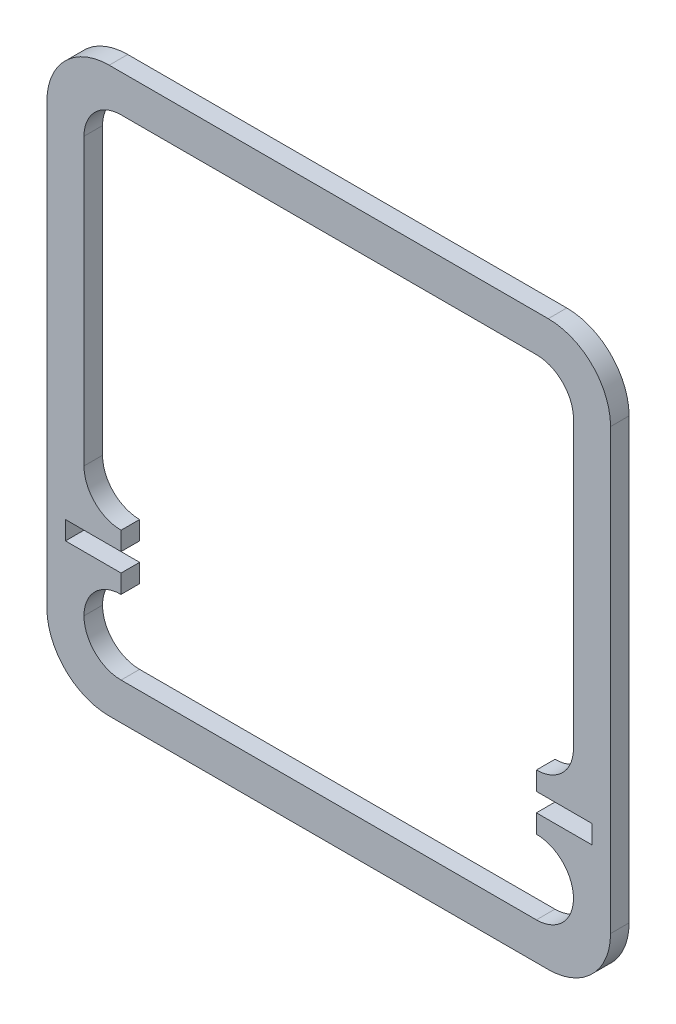
ISO-10303-21;
HEADER;
FILE_DESCRIPTION(('STEP AP214'),'2;1');
FILE_NAME('part.step','',(''),(''),'','','');
FILE_SCHEMA(('AUTOMOTIVE_DESIGN { 1 0 10303 214 1 1 1 1 }'));
ENDSEC;
DATA;
#1=APPLICATION_CONTEXT('core data for automotive mechanical design processes');
#2=APPLICATION_PROTOCOL_DEFINITION('international standard','automotive_design',2000,#1);
#3=PRODUCT_CONTEXT('',#1,'mechanical');
#4=PRODUCT('Part','Part','',(#3));
#5=PRODUCT_RELATED_PRODUCT_CATEGORY('part','',(#4));
#6=PRODUCT_DEFINITION_FORMATION('','',#4);
#7=PRODUCT_DEFINITION_CONTEXT('part definition',#1,'design');
#8=PRODUCT_DEFINITION('design','',#6,#7);
#9=PRODUCT_DEFINITION_SHAPE('','',#8);
#10=(LENGTH_UNIT() NAMED_UNIT(*) SI_UNIT(.MILLI.,.METRE.));
#11=(NAMED_UNIT(*) PLANE_ANGLE_UNIT() SI_UNIT($,.RADIAN.));
#12=(NAMED_UNIT(*) SI_UNIT($,.STERADIAN.) SOLID_ANGLE_UNIT());
#13=UNCERTAINTY_MEASURE_WITH_UNIT(LENGTH_MEASURE(1.E-05),#10,'distance_accuracy_value','');
#14=(GEOMETRIC_REPRESENTATION_CONTEXT(3) GLOBAL_UNCERTAINTY_ASSIGNED_CONTEXT((#13)) GLOBAL_UNIT_ASSIGNED_CONTEXT((#10,
#11,#12)) REPRESENTATION_CONTEXT('',''));
#15=CARTESIAN_POINT('',(0.,0.,0.));
#16=DIRECTION('',(0.,0.,1.));
#17=DIRECTION('',(1.,0.,0.));
#18=AXIS2_PLACEMENT_3D('',#15,#16,#17);
#19=CARTESIAN_POINT('',(0.,0.,3.175));
#20=DIRECTION('',(0.,0.,-1.));
#21=DIRECTION('',(-1.,0.,0.));
#22=AXIS2_PLACEMENT_3D('',#19,#20,#21);
#23=PLANE('',#22);
#24=DIRECTION('',(1.,0.,0.));
#25=VECTOR('',#24,1.);
#26=CARTESIAN_POINT('',(-48.26,-48.26,3.175));
#27=LINE('',#26,#25);
#28=CARTESIAN_POINT('',(-37.592,-48.26,3.175));
#29=VERTEX_POINT('',#28);
#30=CARTESIAN_POINT('',(37.592,-48.26,3.175));
#31=VERTEX_POINT('',#30);
#32=EDGE_CURVE('E383',#29,#31,#27,.T.);
#33=ORIENTED_EDGE('',*,*,#32,.T.);
#34=CARTESIAN_POINT('',(37.592,-37.592,3.175));
#35=DIRECTION('',(0.,0.,-1.));
#36=DIRECTION('',(-1.,0.,0.));
#37=AXIS2_PLACEMENT_3D('',#34,#35,#36);
#38=CIRCLE('',#37,10.668);
#39=CARTESIAN_POINT('',(48.26,-37.592,3.175));
#40=VERTEX_POINT('',#39);
#41=EDGE_CURVE('E420',#31,#40,#38,.F.);
#42=ORIENTED_EDGE('',*,*,#41,.T.);
#43=DIRECTION('',(0.,1.,0.));
#44=VECTOR('',#43,1.);
#45=CARTESIAN_POINT('',(48.26,-48.26,3.175));
#46=LINE('',#45,#44);
#47=CARTESIAN_POINT('',(48.26,37.592,3.175));
#48=VERTEX_POINT('',#47);
#49=EDGE_CURVE('E373',#40,#48,#46,.T.);
#50=ORIENTED_EDGE('',*,*,#49,.T.);
#51=CARTESIAN_POINT('',(37.592,37.592,3.175));
#52=DIRECTION('',(0.,0.,-1.));
#53=DIRECTION('',(-1.,0.,0.));
#54=AXIS2_PLACEMENT_3D('',#51,#52,#53);
#55=CIRCLE('',#54,10.668);
#56=CARTESIAN_POINT('',(37.592,48.26,3.175));
#57=VERTEX_POINT('',#56);
#58=EDGE_CURVE('E418',#48,#57,#55,.F.);
#59=ORIENTED_EDGE('',*,*,#58,.T.);
#60=DIRECTION('',(-1.,0.,0.));
#61=VECTOR('',#60,1.);
#62=CARTESIAN_POINT('',(-48.26,48.26,3.175));
#63=LINE('',#62,#61);
#64=CARTESIAN_POINT('',(-37.592,48.26,3.175));
#65=VERTEX_POINT('',#64);
#66=EDGE_CURVE('E376',#57,#65,#63,.T.);
#67=ORIENTED_EDGE('',*,*,#66,.T.);
#68=CARTESIAN_POINT('',(-37.592,37.592,3.175));
#69=DIRECTION('',(0.,0.,-1.));
#70=DIRECTION('',(-1.,0.,0.));
#71=AXIS2_PLACEMENT_3D('',#68,#69,#70);
#72=CIRCLE('',#71,10.668);
#73=CARTESIAN_POINT('',(-48.26,37.592,3.175));
#74=VERTEX_POINT('',#73);
#75=EDGE_CURVE('E416',#65,#74,#72,.F.);
#76=ORIENTED_EDGE('',*,*,#75,.T.);
#77=DIRECTION('',(0.,-1.,0.));
#78=VECTOR('',#77,1.);
#79=CARTESIAN_POINT('',(-48.26,-48.26,3.175));
#80=LINE('',#79,#78);
#81=CARTESIAN_POINT('',(-48.26,-37.592,3.175));
#82=VERTEX_POINT('',#81);
#83=EDGE_CURVE('E380',#74,#82,#80,.T.);
#84=ORIENTED_EDGE('',*,*,#83,.T.);
#85=CARTESIAN_POINT('',(-37.592,-37.592,3.175));
#86=DIRECTION('',(0.,0.,-1.));
#87=DIRECTION('',(-1.,0.,0.));
#88=AXIS2_PLACEMENT_3D('',#85,#86,#87);
#89=CIRCLE('',#88,10.668);
#90=EDGE_CURVE('E414',#82,#29,#89,.F.);
#91=ORIENTED_EDGE('',*,*,#90,.T.);
#92=EDGE_LOOP('',(#33,#42,#50,#59,#67,#76,#84,#91));
#93=FACE_BOUND('',#92,.T.);
#94=DIRECTION('',(1.,0.,0.));
#95=VECTOR('',#94,1.);
#96=CARTESIAN_POINT('',(-41.91,-41.91,3.175));
#97=LINE('',#96,#95);
#98=CARTESIAN_POINT('',(-35.56,-41.91,3.175));
#99=VERTEX_POINT('',#98);
#100=CARTESIAN_POINT('',(35.56,-41.91,3.175));
#101=VERTEX_POINT('',#100);
#102=EDGE_CURVE('E260',#99,#101,#97,.T.);
#103=ORIENTED_EDGE('',*,*,#102,.F.);
#104=CARTESIAN_POINT('',(-35.56,-35.56,3.175));
#105=DIRECTION('',(0.,0.,-1.));
#106=DIRECTION('',(-1.,0.,0.));
#107=AXIS2_PLACEMENT_3D('',#104,#105,#106);
#108=CIRCLE('',#107,6.35);
#109=CARTESIAN_POINT('',(-41.91,-35.56,3.175));
#110=VERTEX_POINT('',#109);
#111=EDGE_CURVE('E299',#99,#110,#108,.T.);
#112=ORIENTED_EDGE('',*,*,#111,.T.);
#113=CARTESIAN_POINT('',(-35.56,-35.56,3.175));
#114=DIRECTION('',(0.,0.,-1.));
#115=DIRECTION('',(-1.,0.,0.));
#116=AXIS2_PLACEMENT_3D('',#113,#114,#115);
#117=CIRCLE('',#116,6.35);
#118=CARTESIAN_POINT('',(-35.56,-29.21,3.175));
#119=VERTEX_POINT('',#118);
#120=EDGE_CURVE('E11',#110,#119,#117,.T.);
#121=ORIENTED_EDGE('',*,*,#120,.T.);
#122=DIRECTION('',(0.,-1.,0.));
#123=VECTOR('',#122,1.);
#124=CARTESIAN_POINT('',(-35.56,-26.035,3.175));
#125=LINE('',#124,#123);
#126=CARTESIAN_POINT('',(-35.56,-26.035,3.175));
#127=VERTEX_POINT('',#126);
#128=EDGE_CURVE('E353',#127,#119,#125,.T.);
#129=ORIENTED_EDGE('',*,*,#128,.F.);
#130=DIRECTION('',(1.,0.,0.));
#131=VECTOR('',#130,1.);
#132=CARTESIAN_POINT('',(-45.085,-26.035,3.175));
#133=LINE('',#132,#131);
#134=CARTESIAN_POINT('',(-45.085,-26.035,3.175));
#135=VERTEX_POINT('',#134);
#136=EDGE_CURVE('E478',#135,#127,#133,.T.);
#137=ORIENTED_EDGE('',*,*,#136,.F.);
#138=DIRECTION('',(0.,-1.,0.));
#139=VECTOR('',#138,1.);
#140=CARTESIAN_POINT('',(-45.085,-26.035,3.175));
#141=LINE('',#140,#139);
#142=CARTESIAN_POINT('',(-45.085,-22.86,3.175));
#143=VERTEX_POINT('',#142);
#144=EDGE_CURVE('E476',#143,#135,#141,.T.);
#145=ORIENTED_EDGE('',*,*,#144,.F.);
#146=DIRECTION('',(-1.,0.,0.));
#147=VECTOR('',#146,1.);
#148=CARTESIAN_POINT('',(-35.56,-22.86,3.175));
#149=LINE('',#148,#147);
#150=CARTESIAN_POINT('',(-35.56,-22.86,3.175));
#151=VERTEX_POINT('',#150);
#152=EDGE_CURVE('E474',#151,#143,#149,.T.);
#153=ORIENTED_EDGE('',*,*,#152,.F.);
#154=DIRECTION('',(0.,-1.,0.));
#155=VECTOR('',#154,1.);
#156=CARTESIAN_POINT('',(-35.56,-19.685,3.175));
#157=LINE('',#156,#155);
#158=CARTESIAN_POINT('',(-35.56,-19.685,3.175));
#159=VERTEX_POINT('',#158);
#160=EDGE_CURVE('E472',#159,#151,#157,.T.);
#161=ORIENTED_EDGE('',*,*,#160,.F.);
#162=CARTESIAN_POINT('',(-35.56,-13.335,3.175));
#163=DIRECTION('',(0.,0.,-1.));
#164=DIRECTION('',(-1.,0.,0.));
#165=AXIS2_PLACEMENT_3D('',#162,#163,#164);
#166=CIRCLE('',#165,6.35);
#167=CARTESIAN_POINT('',(-41.91,-13.335,3.175));
#168=VERTEX_POINT('',#167);
#169=EDGE_CURVE('E58',#159,#168,#166,.T.);
#170=ORIENTED_EDGE('',*,*,#169,.T.);
#171=DIRECTION('',(0.,-1.,0.));
#172=VECTOR('',#171,1.);
#173=CARTESIAN_POINT('',(-41.91,-19.685,3.175));
#174=LINE('',#173,#172);
#175=CARTESIAN_POINT('',(-41.91,35.56,3.175));
#176=VERTEX_POINT('',#175);
#177=EDGE_CURVE('E329',#176,#168,#174,.T.);
#178=ORIENTED_EDGE('',*,*,#177,.F.);
#179=CARTESIAN_POINT('',(-35.56,35.56,3.175));
#180=DIRECTION('',(0.,0.,-1.));
#181=DIRECTION('',(-1.,0.,0.));
#182=AXIS2_PLACEMENT_3D('',#179,#180,#181);
#183=CIRCLE('',#182,6.35);
#184=CARTESIAN_POINT('',(-35.56,41.91,3.175));
#185=VERTEX_POINT('',#184);
#186=EDGE_CURVE('E300',#176,#185,#183,.T.);
#187=ORIENTED_EDGE('',*,*,#186,.T.);
#188=DIRECTION('',(-1.,0.,0.));
#189=VECTOR('',#188,1.);
#190=CARTESIAN_POINT('',(-41.91,41.91,3.175));
#191=LINE('',#190,#189);
#192=CARTESIAN_POINT('',(35.56,41.91,3.175));
#193=VERTEX_POINT('',#192);
#194=EDGE_CURVE('E448',#193,#185,#191,.T.);
#195=ORIENTED_EDGE('',*,*,#194,.F.);
#196=CARTESIAN_POINT('',(35.56,35.56,3.175));
#197=DIRECTION('',(0.,0.,-1.));
#198=DIRECTION('',(-1.,0.,0.));
#199=AXIS2_PLACEMENT_3D('',#196,#197,#198);
#200=CIRCLE('',#199,6.35);
#201=CARTESIAN_POINT('',(41.91,35.56,3.175));
#202=VERTEX_POINT('',#201);
#203=EDGE_CURVE('E315',#193,#202,#200,.T.);
#204=ORIENTED_EDGE('',*,*,#203,.T.);
#205=DIRECTION('',(0.,1.,0.));
#206=VECTOR('',#205,1.);
#207=CARTESIAN_POINT('',(41.91,-19.6849999999999,3.175));
#208=LINE('',#207,#206);
#209=CARTESIAN_POINT('',(41.91,-13.3349999999999,3.175));
#210=VERTEX_POINT('',#209);
#211=EDGE_CURVE('E456',#210,#202,#208,.T.);
#212=ORIENTED_EDGE('',*,*,#211,.F.);
#213=CARTESIAN_POINT('',(35.56,-13.3349999999999,3.175));
#214=DIRECTION('',(0.,0.,-1.));
#215=DIRECTION('',(-1.,0.,0.));
#216=AXIS2_PLACEMENT_3D('',#213,#214,#215);
#217=CIRCLE('',#216,6.35);
#218=CARTESIAN_POINT('',(35.56,-19.6849999999999,3.175));
#219=VERTEX_POINT('',#218);
#220=EDGE_CURVE('E269',#210,#219,#217,.T.);
#221=ORIENTED_EDGE('',*,*,#220,.T.);
#222=DIRECTION('',(0.,1.,0.));
#223=VECTOR('',#222,1.);
#224=CARTESIAN_POINT('',(35.56,-19.6849999999999,3.175));
#225=LINE('',#224,#223);
#226=CARTESIAN_POINT('',(35.56,-22.8599999999999,3.175));
#227=VERTEX_POINT('',#226);
#228=EDGE_CURVE('E464',#227,#219,#225,.T.);
#229=ORIENTED_EDGE('',*,*,#228,.F.);
#230=DIRECTION('',(-1.,0.,0.));
#231=VECTOR('',#230,1.);
#232=CARTESIAN_POINT('',(35.56,-22.8599999999999,3.175));
#233=LINE('',#232,#231);
#234=CARTESIAN_POINT('',(45.085,-22.8599999999999,3.175));
#235=VERTEX_POINT('',#234);
#236=EDGE_CURVE('E467',#235,#227,#233,.T.);
#237=ORIENTED_EDGE('',*,*,#236,.F.);
#238=DIRECTION('',(0.,1.,0.));
#239=VECTOR('',#238,1.);
#240=CARTESIAN_POINT('',(45.085,-26.0349999999999,3.175));
#241=LINE('',#240,#239);
#242=CARTESIAN_POINT('',(45.085,-26.0349999999999,3.175));
#243=VERTEX_POINT('',#242);
#244=EDGE_CURVE('E505',#243,#235,#241,.T.);
#245=ORIENTED_EDGE('',*,*,#244,.F.);
#246=DIRECTION('',(1.,0.,0.));
#247=VECTOR('',#246,1.);
#248=CARTESIAN_POINT('',(45.085,-26.0349999999999,3.175));
#249=LINE('',#248,#247);
#250=CARTESIAN_POINT('',(35.56,-26.0349999999999,3.175));
#251=VERTEX_POINT('',#250);
#252=EDGE_CURVE('E259',#251,#243,#249,.T.);
#253=ORIENTED_EDGE('',*,*,#252,.F.);
#254=DIRECTION('',(0.,1.,0.));
#255=VECTOR('',#254,1.);
#256=CARTESIAN_POINT('',(35.56,-26.0349999999999,3.175));
#257=LINE('',#256,#255);
#258=CARTESIAN_POINT('',(35.56,-29.2099999999999,3.175));
#259=VERTEX_POINT('',#258);
#260=EDGE_CURVE('E245',#259,#251,#257,.T.);
#261=ORIENTED_EDGE('',*,*,#260,.F.);
#262=CARTESIAN_POINT('',(35.56,-35.5599999999999,3.175));
#263=DIRECTION('',(0.,0.,-1.));
#264=DIRECTION('',(-1.,0.,0.));
#265=AXIS2_PLACEMENT_3D('',#262,#263,#264);
#266=CIRCLE('',#265,6.35);
#267=CARTESIAN_POINT('',(41.91,-35.56,3.175));
#268=VERTEX_POINT('',#267);
#269=EDGE_CURVE('E256',#259,#268,#266,.T.);
#270=ORIENTED_EDGE('',*,*,#269,.T.);
#271=CARTESIAN_POINT('',(35.56,-35.56,3.175));
#272=DIRECTION('',(0.,0.,-1.));
#273=DIRECTION('',(-1.,0.,0.));
#274=AXIS2_PLACEMENT_3D('',#271,#272,#273);
#275=CIRCLE('',#274,6.35);
#276=EDGE_CURVE('E306',#268,#101,#275,.T.);
#277=ORIENTED_EDGE('',*,*,#276,.T.);
#278=EDGE_LOOP('',(#103,#112,#121,#129,#137,#145,#153,#161,#170,#178,#187,#195,#204,#212,#221,
#229,#237,#245,#253,#261,#270,#277));
#279=FACE_BOUND('',#278,.T.);
#280=ADVANCED_FACE('F43',(#93,#279),#23,.F.);
#281=CARTESIAN_POINT('',(0.,0.,0.));
#282=DIRECTION('',(0.,0.,-1.));
#283=DIRECTION('',(-1.,0.,0.));
#284=AXIS2_PLACEMENT_3D('',#281,#282,#283);
#285=PLANE('',#284);
#286=DIRECTION('',(0.,1.,0.));
#287=VECTOR('',#286,1.);
#288=CARTESIAN_POINT('',(48.26,-48.26,0.));
#289=LINE('',#288,#287);
#290=CARTESIAN_POINT('',(48.26,-37.592,0.));
#291=VERTEX_POINT('',#290);
#292=CARTESIAN_POINT('',(48.26,37.592,0.));
#293=VERTEX_POINT('',#292);
#294=EDGE_CURVE('E251',#291,#293,#289,.T.);
#295=ORIENTED_EDGE('',*,*,#294,.F.);
#296=CARTESIAN_POINT('',(37.592,-37.592,0.));
#297=DIRECTION('',(0.,0.,-1.));
#298=DIRECTION('',(-1.,0.,0.));
#299=AXIS2_PLACEMENT_3D('',#296,#297,#298);
#300=CIRCLE('',#299,10.668);
#301=CARTESIAN_POINT('',(37.592,-48.26,0.));
#302=VERTEX_POINT('',#301);
#303=EDGE_CURVE('E407',#291,#302,#300,.T.);
#304=ORIENTED_EDGE('',*,*,#303,.T.);
#305=DIRECTION('',(1.,0.,0.));
#306=VECTOR('',#305,1.);
#307=CARTESIAN_POINT('',(-48.26,-48.26,0.));
#308=LINE('',#307,#306);
#309=CARTESIAN_POINT('',(-37.592,-48.26,0.));
#310=VERTEX_POINT('',#309);
#311=EDGE_CURVE('E377',#310,#302,#308,.T.);
#312=ORIENTED_EDGE('',*,*,#311,.F.);
#313=CARTESIAN_POINT('',(-37.592,-37.592,0.));
#314=DIRECTION('',(0.,0.,-1.));
#315=DIRECTION('',(-1.,0.,0.));
#316=AXIS2_PLACEMENT_3D('',#313,#314,#315);
#317=CIRCLE('',#316,10.668);
#318=CARTESIAN_POINT('',(-48.26,-37.592,0.));
#319=VERTEX_POINT('',#318);
#320=EDGE_CURVE('E401',#310,#319,#317,.T.);
#321=ORIENTED_EDGE('',*,*,#320,.T.);
#322=DIRECTION('',(0.,-1.,0.));
#323=VECTOR('',#322,1.);
#324=CARTESIAN_POINT('',(-48.26,-48.26,0.));
#325=LINE('',#324,#323);
#326=CARTESIAN_POINT('',(-48.26,37.592,0.));
#327=VERTEX_POINT('',#326);
#328=EDGE_CURVE('E392',#327,#319,#325,.T.);
#329=ORIENTED_EDGE('',*,*,#328,.F.);
#330=CARTESIAN_POINT('',(-37.592,37.592,0.));
#331=DIRECTION('',(0.,0.,-1.));
#332=DIRECTION('',(-1.,0.,0.));
#333=AXIS2_PLACEMENT_3D('',#330,#331,#332);
#334=CIRCLE('',#333,10.668);
#335=CARTESIAN_POINT('',(-37.592,48.26,0.));
#336=VERTEX_POINT('',#335);
#337=EDGE_CURVE('E403',#327,#336,#334,.T.);
#338=ORIENTED_EDGE('',*,*,#337,.T.);
#339=DIRECTION('',(-1.,0.,0.));
#340=VECTOR('',#339,1.);
#341=CARTESIAN_POINT('',(-48.26,48.26,0.));
#342=LINE('',#341,#340);
#343=CARTESIAN_POINT('',(37.592,48.26,0.));
#344=VERTEX_POINT('',#343);
#345=EDGE_CURVE('E389',#344,#336,#342,.T.);
#346=ORIENTED_EDGE('',*,*,#345,.F.);
#347=CARTESIAN_POINT('',(37.592,37.592,0.));
#348=DIRECTION('',(0.,0.,-1.));
#349=DIRECTION('',(-1.,0.,0.));
#350=AXIS2_PLACEMENT_3D('',#347,#348,#349);
#351=CIRCLE('',#350,10.668);
#352=EDGE_CURVE('E405',#344,#293,#351,.T.);
#353=ORIENTED_EDGE('',*,*,#352,.T.);
#354=EDGE_LOOP('',(#295,#304,#312,#321,#329,#338,#346,#353));
#355=FACE_BOUND('',#354,.T.);
#356=DIRECTION('',(0.,-1.,0.));
#357=VECTOR('',#356,1.);
#358=CARTESIAN_POINT('',(-35.56,-26.035,0.));
#359=LINE('',#358,#357);
#360=CARTESIAN_POINT('',(-35.56,-26.035,0.));
#361=VERTEX_POINT('',#360);
#362=CARTESIAN_POINT('',(-35.56,-29.21,0.));
#363=VERTEX_POINT('',#362);
#364=EDGE_CURVE('E286',#361,#363,#359,.T.);
#365=ORIENTED_EDGE('',*,*,#364,.T.);
#366=CARTESIAN_POINT('',(-35.56,-35.56,0.));
#367=DIRECTION('',(0.,0.,-1.));
#368=DIRECTION('',(-1.,0.,0.));
#369=AXIS2_PLACEMENT_3D('',#366,#367,#368);
#370=CIRCLE('',#369,6.35);
#371=CARTESIAN_POINT('',(-41.91,-35.56,0.));
#372=VERTEX_POINT('',#371);
#373=EDGE_CURVE('E51',#363,#372,#370,.F.);
#374=ORIENTED_EDGE('',*,*,#373,.T.);
#375=CARTESIAN_POINT('',(-35.56,-35.56,0.));
#376=DIRECTION('',(0.,0.,-1.));
#377=DIRECTION('',(-1.,0.,0.));
#378=AXIS2_PLACEMENT_3D('',#375,#376,#377);
#379=CIRCLE('',#378,6.35);
#380=CARTESIAN_POINT('',(-35.56,-41.91,0.));
#381=VERTEX_POINT('',#380);
#382=EDGE_CURVE('E282',#372,#381,#379,.F.);
#383=ORIENTED_EDGE('',*,*,#382,.T.);
#384=DIRECTION('',(1.,0.,0.));
#385=VECTOR('',#384,1.);
#386=CARTESIAN_POINT('',(-41.91,-41.91,0.));
#387=LINE('',#386,#385);
#388=CARTESIAN_POINT('',(35.56,-41.91,0.));
#389=VERTEX_POINT('',#388);
#390=EDGE_CURVE('E482',#381,#389,#387,.T.);
#391=ORIENTED_EDGE('',*,*,#390,.T.);
#392=CARTESIAN_POINT('',(35.56,-35.56,0.));
#393=DIRECTION('',(0.,0.,-1.));
#394=DIRECTION('',(-1.,0.,0.));
#395=AXIS2_PLACEMENT_3D('',#392,#393,#394);
#396=CIRCLE('',#395,6.35);
#397=CARTESIAN_POINT('',(41.91,-35.56,0.));
#398=VERTEX_POINT('',#397);
#399=EDGE_CURVE('E302',#389,#398,#396,.F.);
#400=ORIENTED_EDGE('',*,*,#399,.T.);
#401=CARTESIAN_POINT('',(35.56,-35.5599999999999,0.));
#402=DIRECTION('',(0.,0.,-1.));
#403=DIRECTION('',(-1.,0.,0.));
#404=AXIS2_PLACEMENT_3D('',#401,#402,#403);
#405=CIRCLE('',#404,6.35);
#406=CARTESIAN_POINT('',(35.56,-29.2099999999999,0.));
#407=VERTEX_POINT('',#406);
#408=EDGE_CURVE('E267',#398,#407,#405,.F.);
#409=ORIENTED_EDGE('',*,*,#408,.T.);
#410=DIRECTION('',(0.,1.,0.));
#411=VECTOR('',#410,1.);
#412=CARTESIAN_POINT('',(35.56,-26.0349999999999,0.));
#413=LINE('',#412,#411);
#414=CARTESIAN_POINT('',(35.56,-26.0349999999999,0.));
#415=VERTEX_POINT('',#414);
#416=EDGE_CURVE('E248',#407,#415,#413,.T.);
#417=ORIENTED_EDGE('',*,*,#416,.T.);
#418=DIRECTION('',(1.,0.,0.));
#419=VECTOR('',#418,1.);
#420=CARTESIAN_POINT('',(45.085,-26.0349999999999,0.));
#421=LINE('',#420,#419);
#422=CARTESIAN_POINT('',(45.085,-26.0349999999999,0.));
#423=VERTEX_POINT('',#422);
#424=EDGE_CURVE('E485',#415,#423,#421,.T.);
#425=ORIENTED_EDGE('',*,*,#424,.T.);
#426=DIRECTION('',(0.,1.,0.));
#427=VECTOR('',#426,1.);
#428=CARTESIAN_POINT('',(45.085,-26.0349999999999,0.));
#429=LINE('',#428,#427);
#430=CARTESIAN_POINT('',(45.085,-22.8599999999999,0.));
#431=VERTEX_POINT('',#430);
#432=EDGE_CURVE('E488',#423,#431,#429,.T.);
#433=ORIENTED_EDGE('',*,*,#432,.T.);
#434=DIRECTION('',(-1.,0.,0.));
#435=VECTOR('',#434,1.);
#436=CARTESIAN_POINT('',(35.56,-22.8599999999999,0.));
#437=LINE('',#436,#435);
#438=CARTESIAN_POINT('',(35.56,-22.8599999999999,0.));
#439=VERTEX_POINT('',#438);
#440=EDGE_CURVE('E491',#431,#439,#437,.T.);
#441=ORIENTED_EDGE('',*,*,#440,.T.);
#442=DIRECTION('',(0.,1.,0.));
#443=VECTOR('',#442,1.);
#444=CARTESIAN_POINT('',(35.56,-19.6849999999999,0.));
#445=LINE('',#444,#443);
#446=CARTESIAN_POINT('',(35.56,-19.6849999999999,0.));
#447=VERTEX_POINT('',#446);
#448=EDGE_CURVE('E494',#439,#447,#445,.T.);
#449=ORIENTED_EDGE('',*,*,#448,.T.);
#450=CARTESIAN_POINT('',(35.56,-13.3349999999999,0.));
#451=DIRECTION('',(0.,0.,-1.));
#452=DIRECTION('',(-1.,0.,0.));
#453=AXIS2_PLACEMENT_3D('',#450,#451,#452);
#454=CIRCLE('',#453,6.35);
#455=CARTESIAN_POINT('',(41.91,-13.3349999999999,0.));
#456=VERTEX_POINT('',#455);
#457=EDGE_CURVE('E266',#447,#456,#454,.F.);
#458=ORIENTED_EDGE('',*,*,#457,.T.);
#459=DIRECTION('',(0.,1.,0.));
#460=VECTOR('',#459,1.);
#461=CARTESIAN_POINT('',(41.91,-19.6849999999999,0.));
#462=LINE('',#461,#460);
#463=CARTESIAN_POINT('',(41.91,35.56,0.));
#464=VERTEX_POINT('',#463);
#465=EDGE_CURVE('E338',#456,#464,#462,.T.);
#466=ORIENTED_EDGE('',*,*,#465,.T.);
#467=CARTESIAN_POINT('',(35.56,35.56,0.));
#468=DIRECTION('',(0.,0.,-1.));
#469=DIRECTION('',(-1.,0.,0.));
#470=AXIS2_PLACEMENT_3D('',#467,#468,#469);
#471=CIRCLE('',#470,6.35);
#472=CARTESIAN_POINT('',(35.56,41.91,0.));
#473=VERTEX_POINT('',#472);
#474=EDGE_CURVE('E313',#464,#473,#471,.F.);
#475=ORIENTED_EDGE('',*,*,#474,.T.);
#476=DIRECTION('',(-1.,0.,0.));
#477=VECTOR('',#476,1.);
#478=CARTESIAN_POINT('',(-41.91,41.91,0.));
#479=LINE('',#478,#477);
#480=CARTESIAN_POINT('',(-35.56,41.91,0.));
#481=VERTEX_POINT('',#480);
#482=EDGE_CURVE('E334',#473,#481,#479,.T.);
#483=ORIENTED_EDGE('',*,*,#482,.T.);
#484=CARTESIAN_POINT('',(-35.56,35.56,0.));
#485=DIRECTION('',(0.,0.,-1.));
#486=DIRECTION('',(-1.,0.,0.));
#487=AXIS2_PLACEMENT_3D('',#484,#485,#486);
#488=CIRCLE('',#487,6.35);
#489=CARTESIAN_POINT('',(-41.91,35.56,0.));
#490=VERTEX_POINT('',#489);
#491=EDGE_CURVE('E318',#481,#490,#488,.F.);
#492=ORIENTED_EDGE('',*,*,#491,.T.);
#493=DIRECTION('',(0.,-1.,0.));
#494=VECTOR('',#493,1.);
#495=CARTESIAN_POINT('',(-41.91,-19.685,0.));
#496=LINE('',#495,#494);
#497=CARTESIAN_POINT('',(-41.91,-13.335,0.));
#498=VERTEX_POINT('',#497);
#499=EDGE_CURVE('E327',#490,#498,#496,.T.);
#500=ORIENTED_EDGE('',*,*,#499,.T.);
#501=CARTESIAN_POINT('',(-35.56,-13.335,0.));
#502=DIRECTION('',(0.,0.,-1.));
#503=DIRECTION('',(-1.,0.,0.));
#504=AXIS2_PLACEMENT_3D('',#501,#502,#503);
#505=CIRCLE('',#504,6.35);
#506=CARTESIAN_POINT('',(-35.56,-19.685,0.));
#507=VERTEX_POINT('',#506);
#508=EDGE_CURVE('E66',#498,#507,#505,.F.);
#509=ORIENTED_EDGE('',*,*,#508,.T.);
#510=DIRECTION('',(0.,-1.,0.));
#511=VECTOR('',#510,1.);
#512=CARTESIAN_POINT('',(-35.56,-19.685,0.));
#513=LINE('',#512,#511);
#514=CARTESIAN_POINT('',(-35.56,-22.86,0.));
#515=VERTEX_POINT('',#514);
#516=EDGE_CURVE('E333',#507,#515,#513,.T.);
#517=ORIENTED_EDGE('',*,*,#516,.T.);
#518=DIRECTION('',(-1.,0.,0.));
#519=VECTOR('',#518,1.);
#520=CARTESIAN_POINT('',(-35.56,-22.86,0.));
#521=LINE('',#520,#519);
#522=CARTESIAN_POINT('',(-45.085,-22.86,0.));
#523=VERTEX_POINT('',#522);
#524=EDGE_CURVE('E336',#515,#523,#521,.T.);
#525=ORIENTED_EDGE('',*,*,#524,.T.);
#526=DIRECTION('',(0.,-1.,0.));
#527=VECTOR('',#526,1.);
#528=CARTESIAN_POINT('',(-45.085,-26.035,0.));
#529=LINE('',#528,#527);
#530=CARTESIAN_POINT('',(-45.085,-26.035,0.));
#531=VERTEX_POINT('',#530);
#532=EDGE_CURVE('E344',#523,#531,#529,.T.);
#533=ORIENTED_EDGE('',*,*,#532,.T.);
#534=DIRECTION('',(1.,0.,0.));
#535=VECTOR('',#534,1.);
#536=CARTESIAN_POINT('',(-45.085,-26.035,0.));
#537=LINE('',#536,#535);
#538=EDGE_CURVE('E347',#531,#361,#537,.T.);
#539=ORIENTED_EDGE('',*,*,#538,.T.);
#540=EDGE_LOOP('',(#365,#374,#383,#391,#400,#409,#417,#425,#433,#441,#449,#458,#466,#475,#483,
#492,#500,#509,#517,#525,#533,#539));
#541=FACE_BOUND('',#540,.T.);
#542=ADVANCED_FACE('F280',(#355,#541),#285,.T.);
#543=CARTESIAN_POINT('',(48.26,-48.26,3.175));
#544=DIRECTION('',(-1.,0.,0.));
#545=DIRECTION('',(0.,0.,1.));
#546=AXIS2_PLACEMENT_3D('',#543,#544,#545);
#547=PLANE('',#546);
#548=ORIENTED_EDGE('',*,*,#49,.F.);
#549=DIRECTION('',(0.,0.,-1.));
#550=VECTOR('',#549,1.);
#551=CARTESIAN_POINT('',(48.26,-37.592,3.175));
#552=LINE('',#551,#550);
#553=EDGE_CURVE('E398',#40,#291,#552,.T.);
#554=ORIENTED_EDGE('',*,*,#553,.T.);
#555=ORIENTED_EDGE('',*,*,#294,.T.);
#556=DIRECTION('',(0.,0.,-1.));
#557=VECTOR('',#556,1.);
#558=CARTESIAN_POINT('',(48.26,37.592,3.175));
#559=LINE('',#558,#557);
#560=EDGE_CURVE('E386',#293,#48,#559,.F.);
#561=ORIENTED_EDGE('',*,*,#560,.T.);
#562=EDGE_LOOP('',(#548,#554,#555,#561));
#563=FACE_BOUND('',#562,.T.);
#564=ADVANCED_FACE('F542',(#563),#547,.F.);
#565=CARTESIAN_POINT('',(-48.26,48.26,3.175));
#566=DIRECTION('',(0.,-1.,0.));
#567=DIRECTION('',(0.,0.,-1.));
#568=AXIS2_PLACEMENT_3D('',#565,#566,#567);
#569=PLANE('',#568);
#570=ORIENTED_EDGE('',*,*,#66,.F.);
#571=DIRECTION('',(0.,0.,-1.));
#572=VECTOR('',#571,1.);
#573=CARTESIAN_POINT('',(37.592,48.26,3.175));
#574=LINE('',#573,#572);
#575=EDGE_CURVE('E424',#57,#344,#574,.T.);
#576=ORIENTED_EDGE('',*,*,#575,.T.);
#577=ORIENTED_EDGE('',*,*,#345,.T.);
#578=DIRECTION('',(0.,0.,-1.));
#579=VECTOR('',#578,1.);
#580=CARTESIAN_POINT('',(-37.592,48.26,3.175));
#581=LINE('',#580,#579);
#582=EDGE_CURVE('E422',#336,#65,#581,.F.);
#583=ORIENTED_EDGE('',*,*,#582,.T.);
#584=EDGE_LOOP('',(#570,#576,#577,#583));
#585=FACE_BOUND('',#584,.T.);
#586=ADVANCED_FACE('F555',(#585),#569,.F.);
#587=CARTESIAN_POINT('',(-48.26,-48.26,3.175));
#588=DIRECTION('',(1.,0.,0.));
#589=DIRECTION('',(0.,0.,-1.));
#590=AXIS2_PLACEMENT_3D('',#587,#588,#589);
#591=PLANE('',#590);
#592=ORIENTED_EDGE('',*,*,#83,.F.);
#593=DIRECTION('',(0.,0.,-1.));
#594=VECTOR('',#593,1.);
#595=CARTESIAN_POINT('',(-48.26,37.592,3.175));
#596=LINE('',#595,#594);
#597=EDGE_CURVE('E429',#74,#327,#596,.T.);
#598=ORIENTED_EDGE('',*,*,#597,.T.);
#599=ORIENTED_EDGE('',*,*,#328,.T.);
#600=DIRECTION('',(0.,0.,-1.));
#601=VECTOR('',#600,1.);
#602=CARTESIAN_POINT('',(-48.26,-37.592,3.175));
#603=LINE('',#602,#601);
#604=EDGE_CURVE('E427',#319,#82,#603,.F.);
#605=ORIENTED_EDGE('',*,*,#604,.T.);
#606=EDGE_LOOP('',(#592,#598,#599,#605));
#607=FACE_BOUND('',#606,.T.);
#608=ADVANCED_FACE('F551',(#607),#591,.F.);
#609=CARTESIAN_POINT('',(-48.26,-48.26,3.175));
#610=DIRECTION('',(0.,1.,0.));
#611=DIRECTION('',(0.,0.,1.));
#612=AXIS2_PLACEMENT_3D('',#609,#610,#611);
#613=PLANE('',#612);
#614=ORIENTED_EDGE('',*,*,#311,.T.);
#615=DIRECTION('',(0.,0.,-1.));
#616=VECTOR('',#615,1.);
#617=CARTESIAN_POINT('',(37.592,-48.26,3.175));
#618=LINE('',#617,#616);
#619=EDGE_CURVE('E412',#302,#31,#618,.F.);
#620=ORIENTED_EDGE('',*,*,#619,.T.);
#621=ORIENTED_EDGE('',*,*,#32,.F.);
#622=DIRECTION('',(0.,0.,-1.));
#623=VECTOR('',#622,1.);
#624=CARTESIAN_POINT('',(-37.592,-48.26,3.175));
#625=LINE('',#624,#623);
#626=EDGE_CURVE('E409',#29,#310,#625,.T.);
#627=ORIENTED_EDGE('',*,*,#626,.T.);
#628=EDGE_LOOP('',(#614,#620,#621,#627));
#629=FACE_BOUND('',#628,.T.);
#630=ADVANCED_FACE('F548',(#629),#613,.F.);
#631=CARTESIAN_POINT('',(-41.91,-41.91,3.175));
#632=DIRECTION('',(0.,1.,0.));
#633=DIRECTION('',(0.,0.,1.));
#634=AXIS2_PLACEMENT_3D('',#631,#632,#633);
#635=PLANE('',#634);
#636=ORIENTED_EDGE('',*,*,#102,.T.);
#637=DIRECTION('',(0.,0.,-1.));
#638=VECTOR('',#637,1.);
#639=CARTESIAN_POINT('',(35.56,-41.91,0.));
#640=LINE('',#639,#638);
#641=EDGE_CURVE('E433',#101,#389,#640,.T.);
#642=ORIENTED_EDGE('',*,*,#641,.T.);
#643=ORIENTED_EDGE('',*,*,#390,.F.);
#644=DIRECTION('',(0.,0.,-1.));
#645=VECTOR('',#644,1.);
#646=CARTESIAN_POINT('',(-35.56,-41.91,3.175));
#647=LINE('',#646,#645);
#648=EDGE_CURVE('E298',#381,#99,#647,.F.);
#649=ORIENTED_EDGE('',*,*,#648,.T.);
#650=EDGE_LOOP('',(#636,#642,#643,#649));
#651=FACE_BOUND('',#650,.T.);
#652=ADVANCED_FACE('F514',(#651),#635,.T.);
#653=CARTESIAN_POINT('',(35.56,-26.0349999999999,3.175));
#654=DIRECTION('',(-1.,0.,0.));
#655=DIRECTION('',(0.,-1.,0.));
#656=AXIS2_PLACEMENT_3D('',#653,#654,#655);
#657=PLANE('',#656);
#658=ORIENTED_EDGE('',*,*,#416,.F.);
#659=DIRECTION('',(0.,0.,-1.));
#660=VECTOR('',#659,1.);
#661=CARTESIAN_POINT('',(35.56,-29.2099999999999,3.175));
#662=LINE('',#661,#660);
#663=EDGE_CURVE('E242',#259,#407,#662,.T.);
#664=ORIENTED_EDGE('',*,*,#663,.F.);
#665=ORIENTED_EDGE('',*,*,#260,.T.);
#666=DIRECTION('',(0.,0.,-1.));
#667=VECTOR('',#666,1.);
#668=CARTESIAN_POINT('',(35.56,-26.0349999999999,3.175));
#669=LINE('',#668,#667);
#670=EDGE_CURVE('E252',#251,#415,#669,.T.);
#671=ORIENTED_EDGE('',*,*,#670,.T.);
#672=EDGE_LOOP('',(#658,#664,#665,#671));
#673=FACE_BOUND('',#672,.T.);
#674=ADVANCED_FACE('F244',(#673),#657,.T.);
#675=CARTESIAN_POINT('',(45.085,-26.0349999999999,3.175));
#676=DIRECTION('',(0.,1.,0.));
#677=DIRECTION('',(0.,0.,1.));
#678=AXIS2_PLACEMENT_3D('',#675,#676,#677);
#679=PLANE('',#678);
#680=ORIENTED_EDGE('',*,*,#424,.F.);
#681=ORIENTED_EDGE('',*,*,#670,.F.);
#682=ORIENTED_EDGE('',*,*,#252,.T.);
#683=DIRECTION('',(0.,0.,-1.));
#684=VECTOR('',#683,1.);
#685=CARTESIAN_POINT('',(45.085,-26.0349999999999,3.175));
#686=LINE('',#685,#684);
#687=EDGE_CURVE('E370',#243,#423,#686,.T.);
#688=ORIENTED_EDGE('',*,*,#687,.T.);
#689=EDGE_LOOP('',(#680,#681,#682,#688));
#690=FACE_BOUND('',#689,.T.);
#691=ADVANCED_FACE('F520',(#690),#679,.T.);
#692=CARTESIAN_POINT('',(45.085,-26.0349999999999,3.175));
#693=DIRECTION('',(-1.,0.,0.));
#694=DIRECTION('',(0.,0.,1.));
#695=AXIS2_PLACEMENT_3D('',#692,#693,#694);
#696=PLANE('',#695);
#697=ORIENTED_EDGE('',*,*,#432,.F.);
#698=ORIENTED_EDGE('',*,*,#687,.F.);
#699=ORIENTED_EDGE('',*,*,#244,.T.);
#700=DIRECTION('',(0.,0.,-1.));
#701=VECTOR('',#700,1.);
#702=CARTESIAN_POINT('',(45.085,-22.8599999999999,3.175));
#703=LINE('',#702,#701);
#704=EDGE_CURVE('E368',#235,#431,#703,.T.);
#705=ORIENTED_EDGE('',*,*,#704,.T.);
#706=EDGE_LOOP('',(#697,#698,#699,#705));
#707=FACE_BOUND('',#706,.T.);
#708=ADVANCED_FACE('F523',(#707),#696,.T.);
#709=CARTESIAN_POINT('',(35.56,-22.8599999999999,3.175));
#710=DIRECTION('',(0.,-1.,0.));
#711=DIRECTION('',(1.,0.,0.));
#712=AXIS2_PLACEMENT_3D('',#709,#710,#711);
#713=PLANE('',#712);
#714=ORIENTED_EDGE('',*,*,#440,.F.);
#715=ORIENTED_EDGE('',*,*,#704,.F.);
#716=ORIENTED_EDGE('',*,*,#236,.T.);
#717=DIRECTION('',(0.,0.,-1.));
#718=VECTOR('',#717,1.);
#719=CARTESIAN_POINT('',(35.56,-22.8599999999999,3.175));
#720=LINE('',#719,#718);
#721=EDGE_CURVE('E366',#227,#439,#720,.T.);
#722=ORIENTED_EDGE('',*,*,#721,.T.);
#723=EDGE_LOOP('',(#714,#715,#716,#722));
#724=FACE_BOUND('',#723,.T.);
#725=ADVANCED_FACE('F525',(#724),#713,.T.);
#726=CARTESIAN_POINT('',(35.56,-19.6849999999999,3.175));
#727=DIRECTION('',(-1.,0.,0.));
#728=DIRECTION('',(0.,0.,1.));
#729=AXIS2_PLACEMENT_3D('',#726,#727,#728);
#730=PLANE('',#729);
#731=ORIENTED_EDGE('',*,*,#448,.F.);
#732=ORIENTED_EDGE('',*,*,#721,.F.);
#733=ORIENTED_EDGE('',*,*,#228,.T.);
#734=DIRECTION('',(0.,0.,-1.));
#735=VECTOR('',#734,1.);
#736=CARTESIAN_POINT('',(35.56,-19.6849999999999,3.175));
#737=LINE('',#736,#735);
#738=EDGE_CURVE('E363',#219,#447,#737,.T.);
#739=ORIENTED_EDGE('',*,*,#738,.T.);
#740=EDGE_LOOP('',(#731,#732,#733,#739));
#741=FACE_BOUND('',#740,.T.);
#742=ADVANCED_FACE('F501',(#741),#730,.T.);
#743=CARTESIAN_POINT('',(41.91,-19.6849999999999,3.175));
#744=DIRECTION('',(-1.,0.,0.));
#745=DIRECTION('',(0.,0.,1.));
#746=AXIS2_PLACEMENT_3D('',#743,#744,#745);
#747=PLANE('',#746);
#748=ORIENTED_EDGE('',*,*,#465,.F.);
#749=DIRECTION('',(0.,0.,-1.));
#750=VECTOR('',#749,1.);
#751=CARTESIAN_POINT('',(41.91,-13.3349999999999,3.175));
#752=LINE('',#751,#750);
#753=EDGE_CURVE('E322',#456,#210,#752,.F.);
#754=ORIENTED_EDGE('',*,*,#753,.T.);
#755=ORIENTED_EDGE('',*,*,#211,.T.);
#756=DIRECTION('',(0.,0.,-1.));
#757=VECTOR('',#756,1.);
#758=CARTESIAN_POINT('',(41.91,35.56,0.));
#759=LINE('',#758,#757);
#760=EDGE_CURVE('E437',#202,#464,#759,.T.);
#761=ORIENTED_EDGE('',*,*,#760,.T.);
#762=EDGE_LOOP('',(#748,#754,#755,#761));
#763=FACE_BOUND('',#762,.T.);
#764=ADVANCED_FACE('F461',(#763),#747,.T.);
#765=CARTESIAN_POINT('',(-41.91,41.91,3.175));
#766=DIRECTION('',(0.,-1.,0.));
#767=DIRECTION('',(1.,0.,0.));
#768=AXIS2_PLACEMENT_3D('',#765,#766,#767);
#769=PLANE('',#768);
#770=ORIENTED_EDGE('',*,*,#482,.F.);
#771=DIRECTION('',(0.,0.,-1.));
#772=VECTOR('',#771,1.);
#773=CARTESIAN_POINT('',(35.56,41.91,3.175));
#774=LINE('',#773,#772);
#775=EDGE_CURVE('E308',#473,#193,#774,.F.);
#776=ORIENTED_EDGE('',*,*,#775,.T.);
#777=ORIENTED_EDGE('',*,*,#194,.T.);
#778=DIRECTION('',(0.,0.,-1.));
#779=VECTOR('',#778,1.);
#780=CARTESIAN_POINT('',(-35.56,41.91,0.));
#781=LINE('',#780,#779);
#782=EDGE_CURVE('E440',#185,#481,#781,.T.);
#783=ORIENTED_EDGE('',*,*,#782,.T.);
#784=EDGE_LOOP('',(#770,#776,#777,#783));
#785=FACE_BOUND('',#784,.T.);
#786=ADVANCED_FACE('F447',(#785),#769,.T.);
#787=CARTESIAN_POINT('',(-41.91,-19.685,3.175));
#788=DIRECTION('',(1.,0.,0.));
#789=DIRECTION('',(0.,0.,-1.));
#790=AXIS2_PLACEMENT_3D('',#787,#788,#789);
#791=PLANE('',#790);
#792=ORIENTED_EDGE('',*,*,#177,.T.);
#793=DIRECTION('',(0.,0.,-1.));
#794=VECTOR('',#793,1.);
#795=CARTESIAN_POINT('',(-41.91,-13.335,0.));
#796=LINE('',#795,#794);
#797=EDGE_CURVE('E271',#168,#498,#796,.T.);
#798=ORIENTED_EDGE('',*,*,#797,.T.);
#799=ORIENTED_EDGE('',*,*,#499,.F.);
#800=DIRECTION('',(0.,0.,-1.));
#801=VECTOR('',#800,1.);
#802=CARTESIAN_POINT('',(-41.91,35.56,3.175));
#803=LINE('',#802,#801);
#804=EDGE_CURVE('E303',#490,#176,#803,.F.);
#805=ORIENTED_EDGE('',*,*,#804,.T.);
#806=EDGE_LOOP('',(#792,#798,#799,#805));
#807=FACE_BOUND('',#806,.T.);
#808=ADVANCED_FACE('F326',(#807),#791,.T.);
#809=CARTESIAN_POINT('',(-35.56,-19.685,3.175));
#810=DIRECTION('',(1.,0.,0.));
#811=DIRECTION('',(0.,0.,-1.));
#812=AXIS2_PLACEMENT_3D('',#809,#810,#811);
#813=PLANE('',#812);
#814=ORIENTED_EDGE('',*,*,#516,.F.);
#815=DIRECTION('',(0.,0.,-1.));
#816=VECTOR('',#815,1.);
#817=CARTESIAN_POINT('',(-35.56,-19.685,3.175));
#818=LINE('',#817,#816);
#819=EDGE_CURVE('E361',#159,#507,#818,.T.);
#820=ORIENTED_EDGE('',*,*,#819,.F.);
#821=ORIENTED_EDGE('',*,*,#160,.T.);
#822=DIRECTION('',(0.,0.,-1.));
#823=VECTOR('',#822,1.);
#824=CARTESIAN_POINT('',(-35.56,-22.86,3.175));
#825=LINE('',#824,#823);
#826=EDGE_CURVE('E359',#151,#515,#825,.T.);
#827=ORIENTED_EDGE('',*,*,#826,.T.);
#828=EDGE_LOOP('',(#814,#820,#821,#827));
#829=FACE_BOUND('',#828,.T.);
#830=ADVANCED_FACE('F598',(#829),#813,.T.);
#831=CARTESIAN_POINT('',(-35.56,-22.86,3.175));
#832=DIRECTION('',(0.,-1.,0.));
#833=DIRECTION('',(1.,0.,0.));
#834=AXIS2_PLACEMENT_3D('',#831,#832,#833);
#835=PLANE('',#834);
#836=ORIENTED_EDGE('',*,*,#524,.F.);
#837=ORIENTED_EDGE('',*,*,#826,.F.);
#838=ORIENTED_EDGE('',*,*,#152,.T.);
#839=DIRECTION('',(0.,0.,-1.));
#840=VECTOR('',#839,1.);
#841=CARTESIAN_POINT('',(-45.085,-22.86,3.175));
#842=LINE('',#841,#840);
#843=EDGE_CURVE('E357',#143,#523,#842,.T.);
#844=ORIENTED_EDGE('',*,*,#843,.T.);
#845=EDGE_LOOP('',(#836,#837,#838,#844));
#846=FACE_BOUND('',#845,.T.);
#847=ADVANCED_FACE('F606',(#846),#835,.T.);
#848=CARTESIAN_POINT('',(-45.085,-26.035,3.175));
#849=DIRECTION('',(1.,0.,0.));
#850=DIRECTION('',(0.,0.,-1.));
#851=AXIS2_PLACEMENT_3D('',#848,#849,#850);
#852=PLANE('',#851);
#853=ORIENTED_EDGE('',*,*,#532,.F.);
#854=ORIENTED_EDGE('',*,*,#843,.F.);
#855=ORIENTED_EDGE('',*,*,#144,.T.);
#856=DIRECTION('',(0.,0.,-1.));
#857=VECTOR('',#856,1.);
#858=CARTESIAN_POINT('',(-45.085,-26.035,3.175));
#859=LINE('',#858,#857);
#860=EDGE_CURVE('E355',#135,#531,#859,.T.);
#861=ORIENTED_EDGE('',*,*,#860,.T.);
#862=EDGE_LOOP('',(#853,#854,#855,#861));
#863=FACE_BOUND('',#862,.T.);
#864=ADVANCED_FACE('F609',(#863),#852,.T.);
#865=CARTESIAN_POINT('',(-45.085,-26.035,3.175));
#866=DIRECTION('',(0.,1.,0.));
#867=DIRECTION('',(0.,0.,1.));
#868=AXIS2_PLACEMENT_3D('',#865,#866,#867);
#869=PLANE('',#868);
#870=ORIENTED_EDGE('',*,*,#538,.F.);
#871=ORIENTED_EDGE('',*,*,#860,.F.);
#872=ORIENTED_EDGE('',*,*,#136,.T.);
#873=DIRECTION('',(0.,0.,-1.));
#874=VECTOR('',#873,1.);
#875=CARTESIAN_POINT('',(-35.56,-26.035,3.175));
#876=LINE('',#875,#874);
#877=EDGE_CURVE('E352',#127,#361,#876,.T.);
#878=ORIENTED_EDGE('',*,*,#877,.T.);
#879=EDGE_LOOP('',(#870,#871,#872,#878));
#880=FACE_BOUND('',#879,.T.);
#881=ADVANCED_FACE('F613',(#880),#869,.T.);
#882=CARTESIAN_POINT('',(-35.56,-26.035,3.175));
#883=DIRECTION('',(1.,0.,0.));
#884=DIRECTION('',(0.,1.,0.));
#885=AXIS2_PLACEMENT_3D('',#882,#883,#884);
#886=PLANE('',#885);
#887=ORIENTED_EDGE('',*,*,#364,.F.);
#888=ORIENTED_EDGE('',*,*,#877,.F.);
#889=ORIENTED_EDGE('',*,*,#128,.T.);
#890=DIRECTION('',(0.,0.,-1.));
#891=VECTOR('',#890,1.);
#892=CARTESIAN_POINT('',(-35.56,-29.21,3.175));
#893=LINE('',#892,#891);
#894=EDGE_CURVE('E350',#119,#363,#893,.T.);
#895=ORIENTED_EDGE('',*,*,#894,.T.);
#896=EDGE_LOOP('',(#887,#888,#889,#895));
#897=FACE_BOUND('',#896,.T.);
#898=ADVANCED_FACE('F567',(#897),#886,.T.);
#899=CARTESIAN_POINT('',(37.592,-37.592,3.175));
#900=DIRECTION('',(0.,0.,-1.));
#901=DIRECTION('',(-1.,0.,0.));
#902=AXIS2_PLACEMENT_3D('',#899,#900,#901);
#903=CYLINDRICAL_SURFACE('',#902,10.668);
#904=ORIENTED_EDGE('',*,*,#41,.F.);
#905=ORIENTED_EDGE('',*,*,#619,.F.);
#906=ORIENTED_EDGE('',*,*,#303,.F.);
#907=ORIENTED_EDGE('',*,*,#553,.F.);
#908=EDGE_LOOP('',(#904,#905,#906,#907));
#909=FACE_BOUND('',#908,.T.);
#910=ADVANCED_FACE('F563',(#909),#903,.T.);
#911=CARTESIAN_POINT('',(37.592,37.592,3.175));
#912=DIRECTION('',(0.,0.,-1.));
#913=DIRECTION('',(-1.,0.,0.));
#914=AXIS2_PLACEMENT_3D('',#911,#912,#913);
#915=CYLINDRICAL_SURFACE('',#914,10.668);
#916=ORIENTED_EDGE('',*,*,#58,.F.);
#917=ORIENTED_EDGE('',*,*,#560,.F.);
#918=ORIENTED_EDGE('',*,*,#352,.F.);
#919=ORIENTED_EDGE('',*,*,#575,.F.);
#920=EDGE_LOOP('',(#916,#917,#918,#919));
#921=FACE_BOUND('',#920,.T.);
#922=ADVANCED_FACE('F566',(#921),#915,.T.);
#923=CARTESIAN_POINT('',(-37.592,37.592,3.175));
#924=DIRECTION('',(0.,0.,-1.));
#925=DIRECTION('',(-1.,0.,0.));
#926=AXIS2_PLACEMENT_3D('',#923,#924,#925);
#927=CYLINDRICAL_SURFACE('',#926,10.668);
#928=ORIENTED_EDGE('',*,*,#75,.F.);
#929=ORIENTED_EDGE('',*,*,#582,.F.);
#930=ORIENTED_EDGE('',*,*,#337,.F.);
#931=ORIENTED_EDGE('',*,*,#597,.F.);
#932=EDGE_LOOP('',(#928,#929,#930,#931));
#933=FACE_BOUND('',#932,.T.);
#934=ADVANCED_FACE('F571',(#933),#927,.T.);
#935=CARTESIAN_POINT('',(-37.592,-37.592,3.175));
#936=DIRECTION('',(0.,0.,-1.));
#937=DIRECTION('',(-1.,0.,0.));
#938=AXIS2_PLACEMENT_3D('',#935,#936,#937);
#939=CYLINDRICAL_SURFACE('',#938,10.668);
#940=ORIENTED_EDGE('',*,*,#90,.F.);
#941=ORIENTED_EDGE('',*,*,#604,.F.);
#942=ORIENTED_EDGE('',*,*,#320,.F.);
#943=ORIENTED_EDGE('',*,*,#626,.F.);
#944=EDGE_LOOP('',(#940,#941,#942,#943));
#945=FACE_BOUND('',#944,.T.);
#946=ADVANCED_FACE('F575',(#945),#939,.T.);
#947=CARTESIAN_POINT('',(35.56,-35.56,3.175));
#948=DIRECTION('',(0.,0.,1.));
#949=DIRECTION('',(1.,0.,0.));
#950=AXIS2_PLACEMENT_3D('',#947,#948,#949);
#951=CYLINDRICAL_SURFACE('',#950,6.35);
#952=ORIENTED_EDGE('',*,*,#276,.F.);
#953=DIRECTION('',(0.,0.,-1.));
#954=VECTOR('',#953,1.);
#955=CARTESIAN_POINT('',(41.91,-35.56,3.175));
#956=LINE('',#955,#954);
#957=EDGE_CURVE('E265',#398,#268,#956,.F.);
#958=ORIENTED_EDGE('',*,*,#957,.F.);
#959=ORIENTED_EDGE('',*,*,#399,.F.);
#960=ORIENTED_EDGE('',*,*,#641,.F.);
#961=EDGE_LOOP('',(#952,#958,#959,#960));
#962=FACE_BOUND('',#961,.T.);
#963=ADVANCED_FACE('F516',(#962),#951,.F.);
#964=CARTESIAN_POINT('',(35.56,35.56,3.175));
#965=DIRECTION('',(0.,0.,1.));
#966=DIRECTION('',(1.,0.,0.));
#967=AXIS2_PLACEMENT_3D('',#964,#965,#966);
#968=CYLINDRICAL_SURFACE('',#967,6.35);
#969=ORIENTED_EDGE('',*,*,#203,.F.);
#970=ORIENTED_EDGE('',*,*,#775,.F.);
#971=ORIENTED_EDGE('',*,*,#474,.F.);
#972=ORIENTED_EDGE('',*,*,#760,.F.);
#973=EDGE_LOOP('',(#969,#970,#971,#972));
#974=FACE_BOUND('',#973,.T.);
#975=ADVANCED_FACE('F458',(#974),#968,.F.);
#976=CARTESIAN_POINT('',(-35.56,35.56,3.175));
#977=DIRECTION('',(0.,0.,1.));
#978=DIRECTION('',(1.,0.,0.));
#979=AXIS2_PLACEMENT_3D('',#976,#977,#978);
#980=CYLINDRICAL_SURFACE('',#979,6.35);
#981=ORIENTED_EDGE('',*,*,#186,.F.);
#982=ORIENTED_EDGE('',*,*,#804,.F.);
#983=ORIENTED_EDGE('',*,*,#491,.F.);
#984=ORIENTED_EDGE('',*,*,#782,.F.);
#985=EDGE_LOOP('',(#981,#982,#983,#984));
#986=FACE_BOUND('',#985,.T.);
#987=ADVANCED_FACE('F584',(#986),#980,.F.);
#988=CARTESIAN_POINT('',(-35.56,-35.56,3.175));
#989=DIRECTION('',(0.,0.,1.));
#990=DIRECTION('',(1.,0.,0.));
#991=AXIS2_PLACEMENT_3D('',#988,#989,#990);
#992=CYLINDRICAL_SURFACE('',#991,6.35);
#993=ORIENTED_EDGE('',*,*,#111,.F.);
#994=ORIENTED_EDGE('',*,*,#648,.F.);
#995=ORIENTED_EDGE('',*,*,#382,.F.);
#996=DIRECTION('',(0.,0.,-1.));
#997=VECTOR('',#996,1.);
#998=CARTESIAN_POINT('',(-41.91,-35.56,0.));
#999=LINE('',#998,#997);
#1000=EDGE_CURVE('E296',#110,#372,#999,.T.);
#1001=ORIENTED_EDGE('',*,*,#1000,.F.);
#1002=EDGE_LOOP('',(#993,#994,#995,#1001));
#1003=FACE_BOUND('',#1002,.T.);
#1004=ADVANCED_FACE('F295',(#1003),#992,.F.);
#1005=CARTESIAN_POINT('',(35.56,-35.5599999999999,3.175));
#1006=DIRECTION('',(0.,0.,1.));
#1007=DIRECTION('',(1.,0.,0.));
#1008=AXIS2_PLACEMENT_3D('',#1005,#1006,#1007);
#1009=CYLINDRICAL_SURFACE('',#1008,6.35);
#1010=ORIENTED_EDGE('',*,*,#269,.F.);
#1011=ORIENTED_EDGE('',*,*,#663,.T.);
#1012=ORIENTED_EDGE('',*,*,#408,.F.);
#1013=ORIENTED_EDGE('',*,*,#957,.T.);
#1014=EDGE_LOOP('',(#1010,#1011,#1012,#1013));
#1015=FACE_BOUND('',#1014,.T.);
#1016=ADVANCED_FACE('F263',(#1015),#1009,.F.);
#1017=CARTESIAN_POINT('',(35.56,-13.3349999999999,3.175));
#1018=DIRECTION('',(0.,0.,1.));
#1019=DIRECTION('',(1.,0.,0.));
#1020=AXIS2_PLACEMENT_3D('',#1017,#1018,#1019);
#1021=CYLINDRICAL_SURFACE('',#1020,6.35);
#1022=ORIENTED_EDGE('',*,*,#220,.F.);
#1023=ORIENTED_EDGE('',*,*,#753,.F.);
#1024=ORIENTED_EDGE('',*,*,#457,.F.);
#1025=ORIENTED_EDGE('',*,*,#738,.F.);
#1026=EDGE_LOOP('',(#1022,#1023,#1024,#1025));
#1027=FACE_BOUND('',#1026,.T.);
#1028=ADVANCED_FACE('F499',(#1027),#1021,.F.);
#1029=CARTESIAN_POINT('',(-35.56,-13.335,3.175));
#1030=DIRECTION('',(0.,0.,1.));
#1031=DIRECTION('',(1.,0.,0.));
#1032=AXIS2_PLACEMENT_3D('',#1029,#1030,#1031);
#1033=CYLINDRICAL_SURFACE('',#1032,6.35);
#1034=ORIENTED_EDGE('',*,*,#169,.F.);
#1035=ORIENTED_EDGE('',*,*,#819,.T.);
#1036=ORIENTED_EDGE('',*,*,#508,.F.);
#1037=ORIENTED_EDGE('',*,*,#797,.F.);
#1038=EDGE_LOOP('',(#1034,#1035,#1036,#1037));
#1039=FACE_BOUND('',#1038,.T.);
#1040=ADVANCED_FACE('F592',(#1039),#1033,.F.);
#1041=CARTESIAN_POINT('',(-35.56,-35.56,3.175));
#1042=DIRECTION('',(0.,0.,1.));
#1043=DIRECTION('',(1.,0.,0.));
#1044=AXIS2_PLACEMENT_3D('',#1041,#1042,#1043);
#1045=CYLINDRICAL_SURFACE('',#1044,6.35);
#1046=ORIENTED_EDGE('',*,*,#120,.F.);
#1047=ORIENTED_EDGE('',*,*,#1000,.T.);
#1048=ORIENTED_EDGE('',*,*,#373,.F.);
#1049=ORIENTED_EDGE('',*,*,#894,.F.);
#1050=EDGE_LOOP('',(#1046,#1047,#1048,#1049));
#1051=FACE_BOUND('',#1050,.T.);
#1052=ADVANCED_FACE('F45',(#1051),#1045,.F.);
#1053=CLOSED_SHELL('',(#280,#542,#564,#586,#608,#630,#652,#674,#691,#708,#725,#742,#764,#786,
#808,#830,#847,#864,#881,#898,#910,#922,#934,#946,#963,#975,#987,#1004,#1016,#1028,#1040,#1052));
#1054=MANIFOLD_SOLID_BREP('B2',#1053);
#1055=ADVANCED_BREP_SHAPE_REPRESENTATION('',(#18,#1054),#14);
#1056=SHAPE_DEFINITION_REPRESENTATION(#9,#1055);
ENDSEC;
END-ISO-10303-21;
